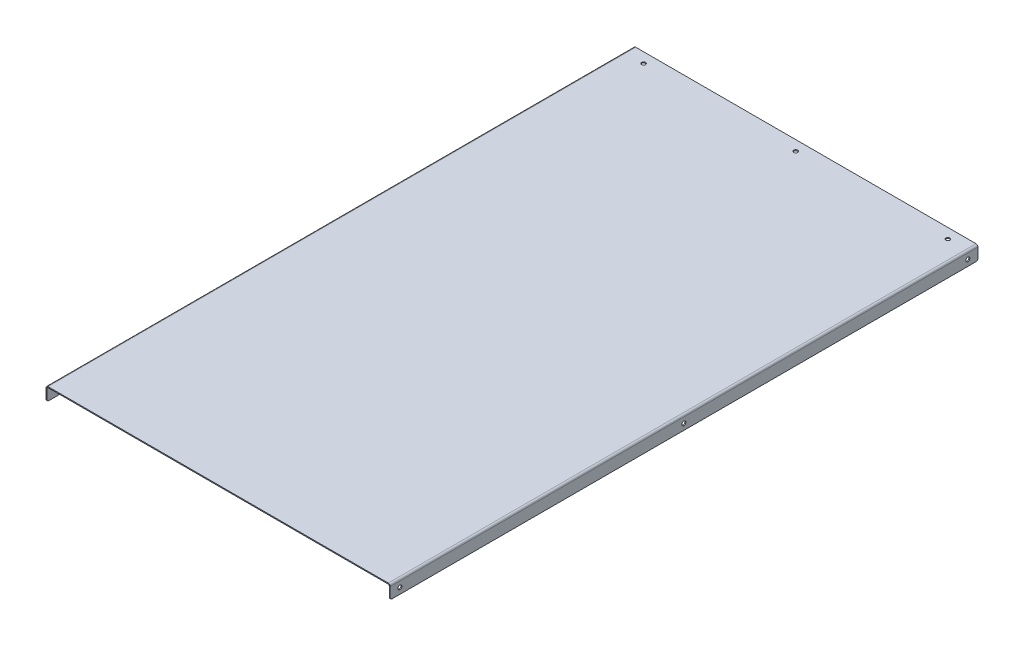
ISO-10303-21;
HEADER;
FILE_DESCRIPTION(('STEP AP214'),'2;1');
FILE_NAME('part.step','',(''),(''),'','','');
FILE_SCHEMA(('AUTOMOTIVE_DESIGN { 1 0 10303 214 1 1 1 1 }'));
ENDSEC;
DATA;
#1=APPLICATION_CONTEXT('core data for automotive mechanical design processes');
#2=APPLICATION_PROTOCOL_DEFINITION('international standard','automotive_design',2000,#1);
#3=PRODUCT_CONTEXT('',#1,'mechanical');
#4=PRODUCT('Part','Part','',(#3));
#5=PRODUCT_RELATED_PRODUCT_CATEGORY('part','',(#4));
#6=PRODUCT_DEFINITION_FORMATION('','',#4);
#7=PRODUCT_DEFINITION_CONTEXT('part definition',#1,'design');
#8=PRODUCT_DEFINITION('design','',#6,#7);
#9=PRODUCT_DEFINITION_SHAPE('','',#8);
#10=(LENGTH_UNIT() NAMED_UNIT(*) SI_UNIT(.MILLI.,.METRE.));
#11=(NAMED_UNIT(*) PLANE_ANGLE_UNIT() SI_UNIT($,.RADIAN.));
#12=(NAMED_UNIT(*) SI_UNIT($,.STERADIAN.) SOLID_ANGLE_UNIT());
#13=UNCERTAINTY_MEASURE_WITH_UNIT(LENGTH_MEASURE(1.E-05),#10,'distance_accuracy_value','');
#14=(GEOMETRIC_REPRESENTATION_CONTEXT(3) GLOBAL_UNCERTAINTY_ASSIGNED_CONTEXT((#13)) GLOBAL_UNIT_ASSIGNED_CONTEXT((#10,
#11,#12)) REPRESENTATION_CONTEXT('',''));
#15=CARTESIAN_POINT('',(0.,0.,0.));
#16=DIRECTION('',(0.,0.,1.));
#17=DIRECTION('',(1.,0.,0.));
#18=AXIS2_PLACEMENT_3D('',#15,#16,#17);
#19=CARTESIAN_POINT('',(-213.0552,0.,0.));
#20=DIRECTION('',(0.,0.,-1.));
#21=DIRECTION('',(-1.,0.,0.));
#22=AXIS2_PLACEMENT_3D('',#19,#20,#21);
#23=PLANE('',#22);
#24=DIRECTION('',(0.,1.,0.));
#25=VECTOR('',#24,1.);
#26=CARTESIAN_POINT('',(-213.0552,0.,0.));
#27=LINE('',#26,#25);
#28=CARTESIAN_POINT('',(-213.0552,0.,0.));
#29=VERTEX_POINT('',#28);
#30=CARTESIAN_POINT('',(-213.0552,1.2192,0.));
#31=VERTEX_POINT('',#30);
#32=EDGE_CURVE('E206',#29,#31,#27,.T.);
#33=ORIENTED_EDGE('',*,*,#32,.F.);
#34=CARTESIAN_POINT('',(-213.0552,-1.27,0.));
#35=DIRECTION('',(0.,0.,1.));
#36=DIRECTION('',(1.,0.,0.));
#37=AXIS2_PLACEMENT_3D('',#34,#35,#36);
#38=CIRCLE('',#37,1.27);
#39=CARTESIAN_POINT('',(-214.3252,-1.27,0.));
#40=VERTEX_POINT('',#39);
#41=EDGE_CURVE('E308',#40,#29,#38,.F.);
#42=ORIENTED_EDGE('',*,*,#41,.F.);
#43=DIRECTION('',(1.,0.,0.));
#44=VECTOR('',#43,1.);
#45=CARTESIAN_POINT('',(-215.5444,-1.27,0.));
#46=LINE('',#45,#44);
#47=CARTESIAN_POINT('',(-215.5444,-1.27,0.));
#48=VERTEX_POINT('',#47);
#49=EDGE_CURVE('E203',#48,#40,#46,.T.);
#50=ORIENTED_EDGE('',*,*,#49,.F.);
#51=CARTESIAN_POINT('',(-213.0552,-1.27,0.));
#52=DIRECTION('',(0.,0.,1.));
#53=DIRECTION('',(1.,0.,0.));
#54=AXIS2_PLACEMENT_3D('',#51,#52,#53);
#55=CIRCLE('',#54,2.4892);
#56=EDGE_CURVE('E301',#48,#31,#55,.F.);
#57=ORIENTED_EDGE('',*,*,#56,.T.);
#58=EDGE_LOOP('',(#33,#42,#50,#57));
#59=FACE_BOUND('',#58,.T.);
#60=ADVANCED_FACE('F37',(#59),#23,.T.);
#61=CARTESIAN_POINT('',(-215.5444,-1.27,0.));
#62=DIRECTION('',(0.,0.,-1.));
#63=DIRECTION('',(-1.,0.,0.));
#64=AXIS2_PLACEMENT_3D('',#61,#62,#63);
#65=PLANE('',#64);
#66=DIRECTION('',(1.,0.,0.));
#67=VECTOR('',#66,1.);
#68=CARTESIAN_POINT('',(-214.3252,0.,0.));
#69=LINE('',#68,#67);
#70=CARTESIAN_POINT('',(213.0552,0.,0.));
#71=VERTEX_POINT('',#70);
#72=EDGE_CURVE('E311',#29,#71,#69,.T.);
#73=ORIENTED_EDGE('',*,*,#72,.F.);
#74=ORIENTED_EDGE('',*,*,#32,.T.);
#75=DIRECTION('',(1.,0.,0.));
#76=VECTOR('',#75,1.);
#77=CARTESIAN_POINT('',(-214.3252,1.2192,0.));
#78=LINE('',#77,#76);
#79=CARTESIAN_POINT('',(213.0552,1.21920000000008,0.));
#80=VERTEX_POINT('',#79);
#81=EDGE_CURVE('E298',#31,#80,#78,.T.);
#82=ORIENTED_EDGE('',*,*,#81,.T.);
#83=DIRECTION('',(0.,-1.,0.));
#84=VECTOR('',#83,1.);
#85=CARTESIAN_POINT('',(213.0552,1.21920000000008,0.));
#86=LINE('',#85,#84);
#87=EDGE_CURVE('E199',#80,#71,#86,.T.);
#88=ORIENTED_EDGE('',*,*,#87,.T.);
#89=EDGE_LOOP('',(#73,#74,#82,#88));
#90=FACE_BOUND('',#89,.T.);
#91=ADVANCED_FACE('F391',(#90),#65,.T.);
#92=CARTESIAN_POINT('',(214.3252,-1.26999999999992,0.));
#93=DIRECTION('',(0.,0.,-1.));
#94=DIRECTION('',(-1.,0.,0.));
#95=AXIS2_PLACEMENT_3D('',#92,#93,#94);
#96=PLANE('',#95);
#97=DIRECTION('',(1.,0.,0.));
#98=VECTOR('',#97,1.);
#99=CARTESIAN_POINT('',(214.3252,-1.26999999999992,0.));
#100=LINE('',#99,#98);
#101=CARTESIAN_POINT('',(214.3252,-1.26999999999992,0.));
#102=VERTEX_POINT('',#101);
#103=CARTESIAN_POINT('',(215.5444,-1.26999999999992,0.));
#104=VERTEX_POINT('',#103);
#105=EDGE_CURVE('E201',#102,#104,#100,.T.);
#106=ORIENTED_EDGE('',*,*,#105,.F.);
#107=CARTESIAN_POINT('',(213.0552,-1.26999999999992,0.));
#108=DIRECTION('',(0.,0.,1.));
#109=DIRECTION('',(1.,0.,0.));
#110=AXIS2_PLACEMENT_3D('',#107,#108,#109);
#111=CIRCLE('',#110,1.27);
#112=EDGE_CURVE('E314',#71,#102,#111,.F.);
#113=ORIENTED_EDGE('',*,*,#112,.F.);
#114=ORIENTED_EDGE('',*,*,#87,.F.);
#115=CARTESIAN_POINT('',(213.0552,-1.26999999999992,0.));
#116=DIRECTION('',(0.,0.,1.));
#117=DIRECTION('',(1.,0.,0.));
#118=AXIS2_PLACEMENT_3D('',#115,#116,#117);
#119=CIRCLE('',#118,2.4892);
#120=EDGE_CURVE('E296',#80,#104,#119,.F.);
#121=ORIENTED_EDGE('',*,*,#120,.T.);
#122=EDGE_LOOP('',(#106,#113,#114,#121));
#123=FACE_BOUND('',#122,.T.);
#124=ADVANCED_FACE('F396',(#123),#96,.T.);
#125=CARTESIAN_POINT('',(213.0552,1.21920000000008,0.));
#126=DIRECTION('',(0.,0.,-1.));
#127=DIRECTION('',(-1.,0.,0.));
#128=AXIS2_PLACEMENT_3D('',#125,#126,#127);
#129=PLANE('',#128);
#130=DIRECTION('',(0.,1.,0.));
#131=VECTOR('',#130,1.);
#132=CARTESIAN_POINT('',(215.5444,0.,0.));
#133=LINE('',#132,#131);
#134=CARTESIAN_POINT('',(215.5444,-13.3349999999999,0.));
#135=VERTEX_POINT('',#134);
#136=EDGE_CURVE('E188',#104,#135,#133,.F.);
#137=ORIENTED_EDGE('',*,*,#136,.T.);
#138=DIRECTION('',(-1.,0.,0.));
#139=VECTOR('',#138,1.);
#140=CARTESIAN_POINT('',(213.0552,-13.3349999999999,0.));
#141=LINE('',#140,#139);
#142=CARTESIAN_POINT('',(214.3252,-13.3349999999999,0.));
#143=VERTEX_POINT('',#142);
#144=EDGE_CURVE('E224',#135,#143,#141,.T.);
#145=ORIENTED_EDGE('',*,*,#144,.T.);
#146=DIRECTION('',(0.,-1.,0.));
#147=VECTOR('',#146,1.);
#148=CARTESIAN_POINT('',(214.3252,0.,0.));
#149=LINE('',#148,#147);
#150=EDGE_CURVE('E173',#102,#143,#149,.T.);
#151=ORIENTED_EDGE('',*,*,#150,.F.);
#152=ORIENTED_EDGE('',*,*,#105,.T.);
#153=EDGE_LOOP('',(#137,#145,#151,#152));
#154=FACE_BOUND('',#153,.T.);
#155=ADVANCED_FACE('F419',(#154),#129,.T.);
#156=CARTESIAN_POINT('',(214.3252,0.,1168.02758970549));
#157=DIRECTION('',(1.,0.,0.));
#158=DIRECTION('',(0.,0.,-1.));
#159=AXIS2_PLACEMENT_3D('',#156,#157,#158);
#160=PLANE('',#159);
#161=CARTESIAN_POINT('',(214.3252,-8.3058,12.6999999999978));
#162=DIRECTION('',(1.,0.,0.));
#163=DIRECTION('',(0.,0.,-1.));
#164=AXIS2_PLACEMENT_3D('',#161,#162,#163);
#165=CIRCLE('',#164,2.47650000000304);
#166=CARTESIAN_POINT('',(214.3252,-8.3058,10.2234999999948));
#167=VERTEX_POINT('',#166);
#168=EDGE_CURVE('E257',#167,#167,#165,.T.);
#169=ORIENTED_EDGE('',*,*,#168,.T.);
#170=EDGE_LOOP('',(#169));
#171=FACE_BOUND('',#170,.T.);
#172=CARTESIAN_POINT('',(214.3252,-8.3058,723.899999999998));
#173=DIRECTION('',(1.,0.,0.));
#174=DIRECTION('',(0.,0.,-1.));
#175=AXIS2_PLACEMENT_3D('',#172,#173,#174);
#176=CIRCLE('',#175,2.47650000000299);
#177=CARTESIAN_POINT('',(214.3252,-8.3058,721.423499999995));
#178=VERTEX_POINT('',#177);
#179=EDGE_CURVE('E244',#178,#178,#176,.T.);
#180=ORIENTED_EDGE('',*,*,#179,.T.);
#181=EDGE_LOOP('',(#180));
#182=FACE_BOUND('',#181,.T.);
#183=CARTESIAN_POINT('',(214.3252,-8.3058,368.299999999998));
#184=DIRECTION('',(1.,0.,0.));
#185=DIRECTION('',(0.,0.,-1.));
#186=AXIS2_PLACEMENT_3D('',#183,#184,#185);
#187=CIRCLE('',#186,2.47650000000301);
#188=CARTESIAN_POINT('',(214.3252,-8.3058,365.823499999995));
#189=VERTEX_POINT('',#188);
#190=EDGE_CURVE('E240',#189,#189,#187,.T.);
#191=ORIENTED_EDGE('',*,*,#190,.T.);
#192=EDGE_LOOP('',(#191));
#193=FACE_BOUND('',#192,.T.);
#194=ORIENTED_EDGE('',*,*,#150,.T.);
#195=CARTESIAN_POINT('',(214.3252,-13.3349999999999,2.54));
#196=DIRECTION('',(1.,0.,0.));
#197=DIRECTION('',(0.,0.,-1.));
#198=AXIS2_PLACEMENT_3D('',#195,#196,#197);
#199=CIRCLE('',#198,2.54);
#200=CARTESIAN_POINT('',(214.3252,-15.8749999999999,2.53999999999999));
#201=VERTEX_POINT('',#200);
#202=EDGE_CURVE('E229',#143,#201,#199,.F.);
#203=ORIENTED_EDGE('',*,*,#202,.T.);
#204=DIRECTION('',(0.,0.,-1.));
#205=VECTOR('',#204,1.);
#206=CARTESIAN_POINT('',(214.3252,-15.8749999999999,1168.02758970549));
#207=LINE('',#206,#205);
#208=CARTESIAN_POINT('',(214.3252,-15.8749999999999,733.552000000013));
#209=VERTEX_POINT('',#208);
#210=EDGE_CURVE('E192',#209,#201,#207,.T.);
#211=ORIENTED_EDGE('',*,*,#210,.F.);
#212=CARTESIAN_POINT('',(214.3252,-13.3349999999999,733.552000000013));
#213=DIRECTION('',(1.,0.,0.));
#214=DIRECTION('',(0.,0.,-1.));
#215=AXIS2_PLACEMENT_3D('',#212,#213,#214);
#216=CIRCLE('',#215,2.54);
#217=CARTESIAN_POINT('',(214.3252,-13.3349999999999,736.092000000013));
#218=VERTEX_POINT('',#217);
#219=EDGE_CURVE('E227',#209,#218,#216,.F.);
#220=ORIENTED_EDGE('',*,*,#219,.T.);
#221=DIRECTION('',(0.,1.,0.));
#222=VECTOR('',#221,1.);
#223=CARTESIAN_POINT('',(214.3252,0.,736.092000000013));
#224=LINE('',#223,#222);
#225=CARTESIAN_POINT('',(214.3252,-1.26999999999992,736.092000000013));
#226=VERTEX_POINT('',#225);
#227=EDGE_CURVE('E162',#218,#226,#224,.T.);
#228=ORIENTED_EDGE('',*,*,#227,.T.);
#229=DIRECTION('',(0.,0.,-1.));
#230=VECTOR('',#229,1.);
#231=CARTESIAN_POINT('',(214.3252,-1.26999999999992,1168.02758970549));
#232=LINE('',#231,#230);
#233=EDGE_CURVE('E317',#226,#102,#232,.T.);
#234=ORIENTED_EDGE('',*,*,#233,.T.);
#235=EDGE_LOOP('',(#194,#203,#211,#220,#228,#234));
#236=FACE_BOUND('',#235,.T.);
#237=ADVANCED_FACE('F414',(#171,#182,#193,#236),#160,.F.);
#238=CARTESIAN_POINT('',(215.5444,-15.8749999999999,1168.02758970549));
#239=DIRECTION('',(0.,-1.,0.));
#240=DIRECTION('',(0.,0.,-1.));
#241=AXIS2_PLACEMENT_3D('',#238,#239,#240);
#242=PLANE('',#241);
#243=ORIENTED_EDGE('',*,*,#210,.T.);
#244=DIRECTION('',(-1.,0.,0.));
#245=VECTOR('',#244,1.);
#246=CARTESIAN_POINT('',(215.5444,-15.8749999999999,2.53999999999999));
#247=LINE('',#246,#245);
#248=CARTESIAN_POINT('',(215.5444,-15.8749999999999,2.53999999999999));
#249=VERTEX_POINT('',#248);
#250=EDGE_CURVE('E62',#201,#249,#247,.F.);
#251=ORIENTED_EDGE('',*,*,#250,.T.);
#252=DIRECTION('',(0.,0.,-1.));
#253=VECTOR('',#252,1.);
#254=CARTESIAN_POINT('',(215.5444,-15.8749999999999,1168.02758970549));
#255=LINE('',#254,#253);
#256=CARTESIAN_POINT('',(215.5444,-15.8749999999999,733.552000000013));
#257=VERTEX_POINT('',#256);
#258=EDGE_CURVE('E190',#257,#249,#255,.T.);
#259=ORIENTED_EDGE('',*,*,#258,.F.);
#260=DIRECTION('',(-1.,0.,0.));
#261=VECTOR('',#260,1.);
#262=CARTESIAN_POINT('',(215.5444,-15.8749999999999,733.552000000013));
#263=LINE('',#262,#261);
#264=EDGE_CURVE('E231',#257,#209,#263,.T.);
#265=ORIENTED_EDGE('',*,*,#264,.T.);
#266=EDGE_LOOP('',(#243,#251,#259,#265));
#267=FACE_BOUND('',#266,.T.);
#268=ADVANCED_FACE('F415',(#267),#242,.T.);
#269=CARTESIAN_POINT('',(215.5444,0.,1168.02758970549));
#270=DIRECTION('',(1.,0.,0.));
#271=DIRECTION('',(0.,0.,-1.));
#272=AXIS2_PLACEMENT_3D('',#269,#270,#271);
#273=PLANE('',#272);
#274=CARTESIAN_POINT('',(215.5444,-8.3058,12.6999999999978));
#275=DIRECTION('',(1.,0.,0.));
#276=DIRECTION('',(0.,0.,-1.));
#277=AXIS2_PLACEMENT_3D('',#274,#275,#276);
#278=CIRCLE('',#277,2.47650000000304);
#279=CARTESIAN_POINT('',(215.5444,-8.3058,10.2234999999948));
#280=VERTEX_POINT('',#279);
#281=EDGE_CURVE('E492',#280,#280,#278,.T.);
#282=ORIENTED_EDGE('',*,*,#281,.F.);
#283=EDGE_LOOP('',(#282));
#284=FACE_BOUND('',#283,.T.);
#285=CARTESIAN_POINT('',(215.5444,-8.3058,723.899999999998));
#286=DIRECTION('',(1.,0.,0.));
#287=DIRECTION('',(0.,0.,-1.));
#288=AXIS2_PLACEMENT_3D('',#285,#286,#287);
#289=CIRCLE('',#288,2.47650000000299);
#290=CARTESIAN_POINT('',(215.5444,-8.3058,721.423499999995));
#291=VERTEX_POINT('',#290);
#292=EDGE_CURVE('E252',#291,#291,#289,.T.);
#293=ORIENTED_EDGE('',*,*,#292,.F.);
#294=EDGE_LOOP('',(#293));
#295=FACE_BOUND('',#294,.T.);
#296=CARTESIAN_POINT('',(215.5444,-8.3058,368.299999999998));
#297=DIRECTION('',(1.,0.,0.));
#298=DIRECTION('',(0.,0.,-1.));
#299=AXIS2_PLACEMENT_3D('',#296,#297,#298);
#300=CIRCLE('',#299,2.47650000000301);
#301=CARTESIAN_POINT('',(215.5444,-8.3058,365.823499999995));
#302=VERTEX_POINT('',#301);
#303=EDGE_CURVE('E249',#302,#302,#300,.T.);
#304=ORIENTED_EDGE('',*,*,#303,.F.);
#305=EDGE_LOOP('',(#304));
#306=FACE_BOUND('',#305,.T.);
#307=ORIENTED_EDGE('',*,*,#258,.T.);
#308=CARTESIAN_POINT('',(215.5444,-13.3349999999999,2.54));
#309=DIRECTION('',(1.,0.,0.));
#310=DIRECTION('',(0.,0.,-1.));
#311=AXIS2_PLACEMENT_3D('',#308,#309,#310);
#312=CIRCLE('',#311,2.54);
#313=EDGE_CURVE('E235',#249,#135,#312,.T.);
#314=ORIENTED_EDGE('',*,*,#313,.T.);
#315=ORIENTED_EDGE('',*,*,#136,.F.);
#316=DIRECTION('',(0.,0.,-1.));
#317=VECTOR('',#316,1.);
#318=CARTESIAN_POINT('',(215.5444,-1.26999999999992,1168.02758970549));
#319=LINE('',#318,#317);
#320=CARTESIAN_POINT('',(215.5444,-1.26999999999992,736.092000000013));
#321=VERTEX_POINT('',#320);
#322=EDGE_CURVE('E180',#321,#104,#319,.T.);
#323=ORIENTED_EDGE('',*,*,#322,.F.);
#324=DIRECTION('',(0.,1.,0.));
#325=VECTOR('',#324,1.);
#326=CARTESIAN_POINT('',(215.5444,0.,736.092000000013));
#327=LINE('',#326,#325);
#328=CARTESIAN_POINT('',(215.5444,-13.3349999999999,736.092000000013));
#329=VERTEX_POINT('',#328);
#330=EDGE_CURVE('E154',#329,#321,#327,.T.);
#331=ORIENTED_EDGE('',*,*,#330,.F.);
#332=CARTESIAN_POINT('',(215.5444,-13.3349999999999,733.552000000013));
#333=DIRECTION('',(1.,0.,0.));
#334=DIRECTION('',(0.,0.,-1.));
#335=AXIS2_PLACEMENT_3D('',#332,#333,#334);
#336=CIRCLE('',#335,2.54);
#337=EDGE_CURVE('E54',#329,#257,#336,.T.);
#338=ORIENTED_EDGE('',*,*,#337,.T.);
#339=EDGE_LOOP('',(#307,#314,#315,#323,#331,#338));
#340=FACE_BOUND('',#339,.T.);
#341=ADVANCED_FACE('F186',(#284,#295,#306,#340),#273,.T.);
#342=CARTESIAN_POINT('',(213.0552,-1.26999999999992,1168.02758970549));
#343=DIRECTION('',(0.,0.,-1.));
#344=DIRECTION('',(-1.,0.,0.));
#345=AXIS2_PLACEMENT_3D('',#342,#343,#344);
#346=CYLINDRICAL_SURFACE('',#345,2.4892);
#347=DIRECTION('',(0.,0.,-1.));
#348=VECTOR('',#347,1.);
#349=CARTESIAN_POINT('',(213.0552,1.21920000000008,1168.02758970549));
#350=LINE('',#349,#348);
#351=CARTESIAN_POINT('',(213.0552,1.21920000000008,736.092000000013));
#352=VERTEX_POINT('',#351);
#353=EDGE_CURVE('E183',#352,#80,#350,.T.);
#354=ORIENTED_EDGE('',*,*,#353,.F.);
#355=CARTESIAN_POINT('',(213.0552,-1.26999999999992,736.092000000013));
#356=DIRECTION('',(0.,0.,1.));
#357=DIRECTION('',(1.,0.,0.));
#358=AXIS2_PLACEMENT_3D('',#355,#356,#357);
#359=CIRCLE('',#358,2.4892);
#360=EDGE_CURVE('E168',#321,#352,#359,.T.);
#361=ORIENTED_EDGE('',*,*,#360,.F.);
#362=ORIENTED_EDGE('',*,*,#322,.T.);
#363=ORIENTED_EDGE('',*,*,#120,.F.);
#364=EDGE_LOOP('',(#354,#361,#362,#363));
#365=FACE_BOUND('',#364,.T.);
#366=ADVANCED_FACE('F178',(#365),#346,.T.);
#367=CARTESIAN_POINT('',(-214.3252,1.2192,1168.02758970549));
#368=DIRECTION('',(0.,1.,0.));
#369=DIRECTION('',(-1.,0.,0.));
#370=AXIS2_PLACEMENT_3D('',#367,#368,#369);
#371=PLANE('',#370);
#372=CARTESIAN_POINT('',(190.500000000005,1.21920000000007,12.6999999999947));
#373=DIRECTION('',(0.,1.,0.));
#374=DIRECTION('',(-1.,0.,0.));
#375=AXIS2_PLACEMENT_3D('',#372,#373,#374);
#376=CIRCLE('',#375,2.47649999999429);
#377=CARTESIAN_POINT('',(188.02350000001,1.21920000000007,12.6999999999947));
#378=VERTEX_POINT('',#377);
#379=EDGE_CURVE('E477',#378,#378,#376,.T.);
#380=ORIENTED_EDGE('',*,*,#379,.F.);
#381=EDGE_LOOP('',(#380));
#382=FACE_BOUND('',#381,.T.);
#383=CARTESIAN_POINT('',(4.72347256060702E-12,1.21920000000004,12.6999999999947));
#384=DIRECTION('',(0.,1.,0.));
#385=DIRECTION('',(-1.,0.,0.));
#386=AXIS2_PLACEMENT_3D('',#383,#384,#385);
#387=CIRCLE('',#386,2.47649999999378);
#388=CARTESIAN_POINT('',(-2.47649999998906,1.21920000000004,12.6999999999947));
#389=VERTEX_POINT('',#388);
#390=EDGE_CURVE('E480',#389,#389,#387,.T.);
#391=ORIENTED_EDGE('',*,*,#390,.F.);
#392=EDGE_LOOP('',(#391));
#393=FACE_BOUND('',#392,.T.);
#394=CARTESIAN_POINT('',(-190.499999999995,1.2192,12.6999999999948));
#395=DIRECTION('',(0.,1.,0.));
#396=DIRECTION('',(-1.,0.,0.));
#397=AXIS2_PLACEMENT_3D('',#394,#395,#396);
#398=CIRCLE('',#397,2.47649999999395);
#399=CARTESIAN_POINT('',(-192.976499999989,1.2192,12.6999999999948));
#400=VERTEX_POINT('',#399);
#401=EDGE_CURVE('E486',#400,#400,#398,.T.);
#402=ORIENTED_EDGE('',*,*,#401,.F.);
#403=EDGE_LOOP('',(#402));
#404=FACE_BOUND('',#403,.T.);
#405=DIRECTION('',(0.,0.,-1.));
#406=VECTOR('',#405,1.);
#407=CARTESIAN_POINT('',(-213.0552,1.2192,1168.02758970549));
#408=LINE('',#407,#406);
#409=CARTESIAN_POINT('',(-213.0552,1.2192,736.092000000013));
#410=VERTEX_POINT('',#409);
#411=EDGE_CURVE('E194',#410,#31,#408,.T.);
#412=ORIENTED_EDGE('',*,*,#411,.F.);
#413=DIRECTION('',(-1.,0.,0.));
#414=VECTOR('',#413,1.);
#415=CARTESIAN_POINT('',(-214.3252,1.2192,736.092000000013));
#416=LINE('',#415,#414);
#417=EDGE_CURVE('E283',#352,#410,#416,.T.);
#418=ORIENTED_EDGE('',*,*,#417,.F.);
#419=ORIENTED_EDGE('',*,*,#353,.T.);
#420=ORIENTED_EDGE('',*,*,#81,.F.);
#421=EDGE_LOOP('',(#412,#418,#419,#420));
#422=FACE_BOUND('',#421,.T.);
#423=ADVANCED_FACE('F347',(#382,#393,#404,#422),#371,.T.);
#424=CARTESIAN_POINT('',(-213.0552,-1.27,1168.02758970549));
#425=DIRECTION('',(0.,0.,-1.));
#426=DIRECTION('',(-1.,0.,0.));
#427=AXIS2_PLACEMENT_3D('',#424,#425,#426);
#428=CYLINDRICAL_SURFACE('',#427,2.4892);
#429=DIRECTION('',(0.,0.,-1.));
#430=VECTOR('',#429,1.);
#431=CARTESIAN_POINT('',(-215.5444,-1.27,1168.02758970549));
#432=LINE('',#431,#430);
#433=CARTESIAN_POINT('',(-215.5444,-1.27,736.092000000013));
#434=VERTEX_POINT('',#433);
#435=EDGE_CURVE('E335',#434,#48,#432,.T.);
#436=ORIENTED_EDGE('',*,*,#435,.F.);
#437=CARTESIAN_POINT('',(-213.0552,-1.27,736.092000000013));
#438=DIRECTION('',(0.,0.,1.));
#439=DIRECTION('',(1.,0.,0.));
#440=AXIS2_PLACEMENT_3D('',#437,#438,#439);
#441=CIRCLE('',#440,2.4892);
#442=EDGE_CURVE('E271',#410,#434,#441,.T.);
#443=ORIENTED_EDGE('',*,*,#442,.F.);
#444=ORIENTED_EDGE('',*,*,#411,.T.);
#445=ORIENTED_EDGE('',*,*,#56,.F.);
#446=EDGE_LOOP('',(#436,#443,#444,#445));
#447=FACE_BOUND('',#446,.T.);
#448=ADVANCED_FACE('F344',(#447),#428,.T.);
#449=CARTESIAN_POINT('',(-215.5444,-15.875,1168.02758970549));
#450=DIRECTION('',(-1.,0.,0.));
#451=DIRECTION('',(0.,0.,1.));
#452=AXIS2_PLACEMENT_3D('',#449,#450,#451);
#453=PLANE('',#452);
#454=CARTESIAN_POINT('',(-215.5444,-8.3058,12.6999999999978));
#455=DIRECTION('',(1.,0.,0.));
#456=DIRECTION('',(0.,0.,-1.));
#457=AXIS2_PLACEMENT_3D('',#454,#455,#456);
#458=CIRCLE('',#457,2.47650000000304);
#459=CARTESIAN_POINT('',(-215.5444,-8.3058,10.2234999999948));
#460=VERTEX_POINT('',#459);
#461=EDGE_CURVE('E495',#460,#460,#458,.T.);
#462=ORIENTED_EDGE('',*,*,#461,.T.);
#463=EDGE_LOOP('',(#462));
#464=FACE_BOUND('',#463,.T.);
#465=CARTESIAN_POINT('',(-215.5444,-8.3058,723.899999999998));
#466=DIRECTION('',(1.,0.,0.));
#467=DIRECTION('',(0.,0.,-1.));
#468=AXIS2_PLACEMENT_3D('',#465,#466,#467);
#469=CIRCLE('',#468,2.47650000000299);
#470=CARTESIAN_POINT('',(-215.5444,-8.3058,721.423499999995));
#471=VERTEX_POINT('',#470);
#472=EDGE_CURVE('E245',#471,#471,#469,.T.);
#473=ORIENTED_EDGE('',*,*,#472,.T.);
#474=EDGE_LOOP('',(#473));
#475=FACE_BOUND('',#474,.T.);
#476=CARTESIAN_POINT('',(-215.5444,-8.3058,368.299999999998));
#477=DIRECTION('',(1.,0.,0.));
#478=DIRECTION('',(0.,0.,-1.));
#479=AXIS2_PLACEMENT_3D('',#476,#477,#478);
#480=CIRCLE('',#479,2.47650000000301);
#481=CARTESIAN_POINT('',(-215.5444,-8.3058,365.823499999995));
#482=VERTEX_POINT('',#481);
#483=EDGE_CURVE('E241',#482,#482,#480,.T.);
#484=ORIENTED_EDGE('',*,*,#483,.T.);
#485=EDGE_LOOP('',(#484));
#486=FACE_BOUND('',#485,.T.);
#487=DIRECTION('',(0.,1.,0.));
#488=VECTOR('',#487,1.);
#489=CARTESIAN_POINT('',(-215.5444,-15.875,0.));
#490=LINE('',#489,#488);
#491=CARTESIAN_POINT('',(-215.5444,-13.335,0.));
#492=VERTEX_POINT('',#491);
#493=EDGE_CURVE('E304',#492,#48,#490,.T.);
#494=ORIENTED_EDGE('',*,*,#493,.F.);
#495=CARTESIAN_POINT('',(-215.5444,-13.335,2.54));
#496=DIRECTION('',(-1.,0.,0.));
#497=DIRECTION('',(0.,0.,1.));
#498=AXIS2_PLACEMENT_3D('',#495,#496,#497);
#499=CIRCLE('',#498,2.54);
#500=CARTESIAN_POINT('',(-215.5444,-15.875,2.53999999999999));
#501=VERTEX_POINT('',#500);
#502=EDGE_CURVE('E213',#492,#501,#499,.T.);
#503=ORIENTED_EDGE('',*,*,#502,.T.);
#504=DIRECTION('',(0.,0.,-1.));
#505=VECTOR('',#504,1.);
#506=CARTESIAN_POINT('',(-215.5444,-15.875,1168.02758970549));
#507=LINE('',#506,#505);
#508=CARTESIAN_POINT('',(-215.5444,-15.875,733.552000000013));
#509=VERTEX_POINT('',#508);
#510=EDGE_CURVE('E332',#509,#501,#507,.T.);
#511=ORIENTED_EDGE('',*,*,#510,.F.);
#512=CARTESIAN_POINT('',(-215.5444,-13.335,733.552000000013));
#513=DIRECTION('',(-1.,0.,0.));
#514=DIRECTION('',(0.,0.,1.));
#515=AXIS2_PLACEMENT_3D('',#512,#513,#514);
#516=CIRCLE('',#515,2.54);
#517=CARTESIAN_POINT('',(-215.5444,-13.335,736.092000000013));
#518=VERTEX_POINT('',#517);
#519=EDGE_CURVE('E211',#509,#518,#516,.T.);
#520=ORIENTED_EDGE('',*,*,#519,.T.);
#521=DIRECTION('',(0.,1.,0.));
#522=VECTOR('',#521,1.);
#523=CARTESIAN_POINT('',(-215.5444,-15.875,736.092000000013));
#524=LINE('',#523,#522);
#525=EDGE_CURVE('E274',#434,#518,#524,.F.);
#526=ORIENTED_EDGE('',*,*,#525,.F.);
#527=ORIENTED_EDGE('',*,*,#435,.T.);
#528=EDGE_LOOP('',(#494,#503,#511,#520,#526,#527));
#529=FACE_BOUND('',#528,.T.);
#530=ADVANCED_FACE('F357',(#464,#475,#486,#529),#453,.T.);
#531=CARTESIAN_POINT('',(-214.3252,-15.875,1168.02758970549));
#532=DIRECTION('',(0.,-1.,0.));
#533=DIRECTION('',(0.,0.,-1.));
#534=AXIS2_PLACEMENT_3D('',#531,#532,#533);
#535=PLANE('',#534);
#536=ORIENTED_EDGE('',*,*,#510,.T.);
#537=DIRECTION('',(-1.,0.,0.));
#538=VECTOR('',#537,1.);
#539=CARTESIAN_POINT('',(-214.3252,-15.875,2.54));
#540=LINE('',#539,#538);
#541=CARTESIAN_POINT('',(-214.3252,-15.875,2.53999999999999));
#542=VERTEX_POINT('',#541);
#543=EDGE_CURVE('E218',#501,#542,#540,.F.);
#544=ORIENTED_EDGE('',*,*,#543,.T.);
#545=DIRECTION('',(0.,0.,-1.));
#546=VECTOR('',#545,1.);
#547=CARTESIAN_POINT('',(-214.3252,-15.875,1168.02758970549));
#548=LINE('',#547,#546);
#549=CARTESIAN_POINT('',(-214.3252,-15.875,733.552000000013));
#550=VERTEX_POINT('',#549);
#551=EDGE_CURVE('E329',#550,#542,#548,.T.);
#552=ORIENTED_EDGE('',*,*,#551,.F.);
#553=DIRECTION('',(1.,0.,0.));
#554=VECTOR('',#553,1.);
#555=CARTESIAN_POINT('',(-214.3252,-15.875,733.552000000013));
#556=LINE('',#555,#554);
#557=EDGE_CURVE('E215',#550,#509,#556,.F.);
#558=ORIENTED_EDGE('',*,*,#557,.T.);
#559=EDGE_LOOP('',(#536,#544,#552,#558));
#560=FACE_BOUND('',#559,.T.);
#561=ADVANCED_FACE('F372',(#560),#535,.T.);
#562=CARTESIAN_POINT('',(-214.3252,-15.875,1168.02758970549));
#563=DIRECTION('',(-1.,0.,0.));
#564=DIRECTION('',(0.,0.,1.));
#565=AXIS2_PLACEMENT_3D('',#562,#563,#564);
#566=PLANE('',#565);
#567=CARTESIAN_POINT('',(-214.3252,-8.3058,12.6999999999978));
#568=DIRECTION('',(-1.,0.,0.));
#569=DIRECTION('',(0.,0.,1.));
#570=AXIS2_PLACEMENT_3D('',#567,#568,#569);
#571=CIRCLE('',#570,2.47650000000304);
#572=CARTESIAN_POINT('',(-214.3252,-8.3058,15.1765000000009));
#573=VERTEX_POINT('',#572);
#574=EDGE_CURVE('E41',#573,#573,#571,.T.);
#575=ORIENTED_EDGE('',*,*,#574,.T.);
#576=EDGE_LOOP('',(#575));
#577=FACE_BOUND('',#576,.T.);
#578=CARTESIAN_POINT('',(-214.3252,-8.3058,723.899999999998));
#579=DIRECTION('',(-1.,0.,0.));
#580=DIRECTION('',(0.,0.,1.));
#581=AXIS2_PLACEMENT_3D('',#578,#579,#580);
#582=CIRCLE('',#581,2.47650000000299);
#583=CARTESIAN_POINT('',(-214.3252,-8.3058,726.376500000001));
#584=VERTEX_POINT('',#583);
#585=EDGE_CURVE('E242',#584,#584,#582,.T.);
#586=ORIENTED_EDGE('',*,*,#585,.T.);
#587=EDGE_LOOP('',(#586));
#588=FACE_BOUND('',#587,.T.);
#589=CARTESIAN_POINT('',(-214.3252,-8.3058,368.299999999998));
#590=DIRECTION('',(-1.,0.,0.));
#591=DIRECTION('',(0.,0.,1.));
#592=AXIS2_PLACEMENT_3D('',#589,#590,#591);
#593=CIRCLE('',#592,2.47650000000301);
#594=CARTESIAN_POINT('',(-214.3252,-8.3058,370.776500000001));
#595=VERTEX_POINT('',#594);
#596=EDGE_CURVE('E238',#595,#595,#593,.T.);
#597=ORIENTED_EDGE('',*,*,#596,.T.);
#598=EDGE_LOOP('',(#597));
#599=FACE_BOUND('',#598,.T.);
#600=ORIENTED_EDGE('',*,*,#551,.T.);
#601=CARTESIAN_POINT('',(-214.3252,-13.335,2.54));
#602=DIRECTION('',(-1.,0.,0.));
#603=DIRECTION('',(0.,0.,1.));
#604=AXIS2_PLACEMENT_3D('',#601,#602,#603);
#605=CIRCLE('',#604,2.54);
#606=CARTESIAN_POINT('',(-214.3252,-13.335,0.));
#607=VERTEX_POINT('',#606);
#608=EDGE_CURVE('E222',#542,#607,#605,.F.);
#609=ORIENTED_EDGE('',*,*,#608,.T.);
#610=DIRECTION('',(0.,1.,0.));
#611=VECTOR('',#610,1.);
#612=CARTESIAN_POINT('',(-214.3252,-15.875,0.));
#613=LINE('',#612,#611);
#614=EDGE_CURVE('E306',#607,#40,#613,.T.);
#615=ORIENTED_EDGE('',*,*,#614,.T.);
#616=DIRECTION('',(0.,0.,-1.));
#617=VECTOR('',#616,1.);
#618=CARTESIAN_POINT('',(-214.3252,-1.27,1168.02758970549));
#619=LINE('',#618,#617);
#620=CARTESIAN_POINT('',(-214.3252,-1.27,736.092000000013));
#621=VERTEX_POINT('',#620);
#622=EDGE_CURVE('E326',#621,#40,#619,.T.);
#623=ORIENTED_EDGE('',*,*,#622,.F.);
#624=DIRECTION('',(0.,-1.,0.));
#625=VECTOR('',#624,1.);
#626=CARTESIAN_POINT('',(-214.3252,-15.875,736.092000000013));
#627=LINE('',#626,#625);
#628=CARTESIAN_POINT('',(-214.3252,-13.335,736.092000000013));
#629=VERTEX_POINT('',#628);
#630=EDGE_CURVE('E273',#621,#629,#627,.T.);
#631=ORIENTED_EDGE('',*,*,#630,.T.);
#632=CARTESIAN_POINT('',(-214.3252,-13.335,733.552000000013));
#633=DIRECTION('',(-1.,0.,0.));
#634=DIRECTION('',(0.,0.,1.));
#635=AXIS2_PLACEMENT_3D('',#632,#633,#634);
#636=CIRCLE('',#635,2.54);
#637=EDGE_CURVE('E220',#629,#550,#636,.F.);
#638=ORIENTED_EDGE('',*,*,#637,.T.);
#639=EDGE_LOOP('',(#600,#609,#615,#623,#631,#638));
#640=FACE_BOUND('',#639,.T.);
#641=ADVANCED_FACE('F368',(#577,#588,#599,#640),#566,.F.);
#642=CARTESIAN_POINT('',(-213.0552,-1.27,1168.02758970549));
#643=DIRECTION('',(0.,0.,-1.));
#644=DIRECTION('',(-1.,0.,0.));
#645=AXIS2_PLACEMENT_3D('',#642,#643,#644);
#646=CYLINDRICAL_SURFACE('',#645,1.27);
#647=CARTESIAN_POINT('',(-213.0552,-1.27,736.092000000013));
#648=DIRECTION('',(0.,0.,-1.));
#649=DIRECTION('',(-1.,0.,0.));
#650=AXIS2_PLACEMENT_3D('',#647,#648,#649);
#651=CIRCLE('',#650,1.27);
#652=CARTESIAN_POINT('',(-213.0552,0.,736.092000000013));
#653=VERTEX_POINT('',#652);
#654=EDGE_CURVE('E184',#653,#621,#651,.F.);
#655=ORIENTED_EDGE('',*,*,#654,.T.);
#656=ORIENTED_EDGE('',*,*,#622,.T.);
#657=ORIENTED_EDGE('',*,*,#41,.T.);
#658=DIRECTION('',(0.,0.,-1.));
#659=VECTOR('',#658,1.);
#660=CARTESIAN_POINT('',(-213.0552,0.,1168.02758970549));
#661=LINE('',#660,#659);
#662=EDGE_CURVE('E323',#653,#29,#661,.T.);
#663=ORIENTED_EDGE('',*,*,#662,.F.);
#664=EDGE_LOOP('',(#655,#656,#657,#663));
#665=FACE_BOUND('',#664,.T.);
#666=ADVANCED_FACE('F428',(#665),#646,.F.);
#667=CARTESIAN_POINT('',(-214.3252,0.,1168.02758970549));
#668=DIRECTION('',(0.,1.,0.));
#669=DIRECTION('',(-1.,0.,0.));
#670=AXIS2_PLACEMENT_3D('',#667,#668,#669);
#671=PLANE('',#670);
#672=CARTESIAN_POINT('',(190.500000000005,0.,12.6999999999947));
#673=DIRECTION('',(0.,1.,0.));
#674=DIRECTION('',(-1.,0.,0.));
#675=AXIS2_PLACEMENT_3D('',#672,#673,#674);
#676=CIRCLE('',#675,2.47649999999429);
#677=CARTESIAN_POINT('',(188.02350000001,0.,12.6999999999947));
#678=VERTEX_POINT('',#677);
#679=EDGE_CURVE('E474',#678,#678,#676,.T.);
#680=ORIENTED_EDGE('',*,*,#679,.T.);
#681=EDGE_LOOP('',(#680));
#682=FACE_BOUND('',#681,.T.);
#683=CARTESIAN_POINT('',(4.723696516617E-12,0.,12.6999999999947));
#684=DIRECTION('',(0.,1.,0.));
#685=DIRECTION('',(-1.,0.,0.));
#686=AXIS2_PLACEMENT_3D('',#683,#684,#685);
#687=CIRCLE('',#686,2.47649999999378);
#688=CARTESIAN_POINT('',(-2.47649999998906,0.,12.6999999999947));
#689=VERTEX_POINT('',#688);
#690=EDGE_CURVE('E483',#689,#689,#687,.T.);
#691=ORIENTED_EDGE('',*,*,#690,.T.);
#692=EDGE_LOOP('',(#691));
#693=FACE_BOUND('',#692,.T.);
#694=CARTESIAN_POINT('',(-190.499999999995,0.,12.6999999999948));
#695=DIRECTION('',(0.,1.,0.));
#696=DIRECTION('',(-1.,0.,0.));
#697=AXIS2_PLACEMENT_3D('',#694,#695,#696);
#698=CIRCLE('',#697,2.47649999999395);
#699=CARTESIAN_POINT('',(-192.976499999989,0.,12.6999999999948));
#700=VERTEX_POINT('',#699);
#701=EDGE_CURVE('E489',#700,#700,#698,.T.);
#702=ORIENTED_EDGE('',*,*,#701,.T.);
#703=EDGE_LOOP('',(#702));
#704=FACE_BOUND('',#703,.T.);
#705=DIRECTION('',(-1.,0.,0.));
#706=VECTOR('',#705,1.);
#707=CARTESIAN_POINT('',(-214.3252,0.,736.092000000013));
#708=LINE('',#707,#706);
#709=CARTESIAN_POINT('',(213.0552,0.,736.092000000013));
#710=VERTEX_POINT('',#709);
#711=EDGE_CURVE('E282',#710,#653,#708,.T.);
#712=ORIENTED_EDGE('',*,*,#711,.T.);
#713=ORIENTED_EDGE('',*,*,#662,.T.);
#714=ORIENTED_EDGE('',*,*,#72,.T.);
#715=DIRECTION('',(0.,0.,-1.));
#716=VECTOR('',#715,1.);
#717=CARTESIAN_POINT('',(213.0552,0.,1168.02758970549));
#718=LINE('',#717,#716);
#719=EDGE_CURVE('E320',#710,#71,#718,.T.);
#720=ORIENTED_EDGE('',*,*,#719,.F.);
#721=EDGE_LOOP('',(#712,#713,#714,#720));
#722=FACE_BOUND('',#721,.T.);
#723=ADVANCED_FACE('F387',(#682,#693,#704,#722),#671,.F.);
#724=CARTESIAN_POINT('',(213.0552,-1.26999999999992,1168.02758970549));
#725=DIRECTION('',(0.,0.,-1.));
#726=DIRECTION('',(-1.,0.,0.));
#727=AXIS2_PLACEMENT_3D('',#724,#725,#726);
#728=CYLINDRICAL_SURFACE('',#727,1.27);
#729=CARTESIAN_POINT('',(213.0552,-1.26999999999992,736.092000000013));
#730=DIRECTION('',(0.,0.,-1.));
#731=DIRECTION('',(-1.,0.,0.));
#732=AXIS2_PLACEMENT_3D('',#729,#730,#731);
#733=CIRCLE('',#732,1.27);
#734=EDGE_CURVE('E171',#226,#710,#733,.F.);
#735=ORIENTED_EDGE('',*,*,#734,.T.);
#736=ORIENTED_EDGE('',*,*,#719,.T.);
#737=ORIENTED_EDGE('',*,*,#112,.T.);
#738=ORIENTED_EDGE('',*,*,#233,.F.);
#739=EDGE_LOOP('',(#735,#736,#737,#738));
#740=FACE_BOUND('',#739,.T.);
#741=ADVANCED_FACE('F379',(#740),#728,.F.);
#742=CARTESIAN_POINT('',(213.0552,-1.26999999999992,0.));
#743=DIRECTION('',(0.,0.,1.));
#744=DIRECTION('',(1.,0.,0.));
#745=AXIS2_PLACEMENT_3D('',#742,#743,#744);
#746=PLANE('',#745);
#747=ORIENTED_EDGE('',*,*,#614,.F.);
#748=DIRECTION('',(-1.,0.,0.));
#749=VECTOR('',#748,1.);
#750=CARTESIAN_POINT('',(-215.5444,-13.335,0.));
#751=LINE('',#750,#749);
#752=EDGE_CURVE('E208',#607,#492,#751,.T.);
#753=ORIENTED_EDGE('',*,*,#752,.T.);
#754=ORIENTED_EDGE('',*,*,#493,.T.);
#755=ORIENTED_EDGE('',*,*,#49,.T.);
#756=EDGE_LOOP('',(#747,#753,#754,#755));
#757=FACE_BOUND('',#756,.T.);
#758=ADVANCED_FACE('F377',(#757),#746,.F.);
#759=CARTESIAN_POINT('',(214.3252,0.,736.092000000013));
#760=DIRECTION('',(0.,0.,-1.));
#761=DIRECTION('',(0.,1.,0.));
#762=AXIS2_PLACEMENT_3D('',#759,#760,#761);
#763=PLANE('',#762);
#764=ORIENTED_EDGE('',*,*,#227,.F.);
#765=DIRECTION('',(1.,0.,0.));
#766=VECTOR('',#765,1.);
#767=CARTESIAN_POINT('',(214.3252,-13.3349999999999,736.092000000013));
#768=LINE('',#767,#766);
#769=EDGE_CURVE('E46',#218,#329,#768,.T.);
#770=ORIENTED_EDGE('',*,*,#769,.T.);
#771=ORIENTED_EDGE('',*,*,#330,.T.);
#772=DIRECTION('',(-1.,0.,0.));
#773=VECTOR('',#772,1.);
#774=CARTESIAN_POINT('',(214.3252,-1.26999999999992,736.092000000013));
#775=LINE('',#774,#773);
#776=EDGE_CURVE('E158',#226,#321,#775,.F.);
#777=ORIENTED_EDGE('',*,*,#776,.F.);
#778=EDGE_LOOP('',(#764,#770,#771,#777));
#779=FACE_BOUND('',#778,.T.);
#780=ADVANCED_FACE('F157',(#779),#763,.F.);
#781=CARTESIAN_POINT('',(-214.3252,0.,736.092000000013));
#782=DIRECTION('',(0.,0.,-1.));
#783=DIRECTION('',(-1.,0.,0.));
#784=AXIS2_PLACEMENT_3D('',#781,#782,#783);
#785=PLANE('',#784);
#786=DIRECTION('',(0.,-1.,0.));
#787=VECTOR('',#786,1.);
#788=CARTESIAN_POINT('',(-213.0552,0.,736.092000000013));
#789=LINE('',#788,#787);
#790=EDGE_CURVE('E288',#653,#410,#789,.F.);
#791=ORIENTED_EDGE('',*,*,#790,.F.);
#792=ORIENTED_EDGE('',*,*,#711,.F.);
#793=DIRECTION('',(0.,-1.,0.));
#794=VECTOR('',#793,1.);
#795=CARTESIAN_POINT('',(213.0552,0.,736.092000000013));
#796=LINE('',#795,#794);
#797=EDGE_CURVE('E285',#710,#352,#796,.F.);
#798=ORIENTED_EDGE('',*,*,#797,.T.);
#799=ORIENTED_EDGE('',*,*,#417,.T.);
#800=EDGE_LOOP('',(#791,#792,#798,#799));
#801=FACE_BOUND('',#800,.T.);
#802=ADVANCED_FACE('F385',(#801),#785,.F.);
#803=CARTESIAN_POINT('',(-214.3252,-15.875,736.092000000013));
#804=DIRECTION('',(0.,0.,-1.));
#805=DIRECTION('',(0.,-1.,0.));
#806=AXIS2_PLACEMENT_3D('',#803,#804,#805);
#807=PLANE('',#806);
#808=ORIENTED_EDGE('',*,*,#525,.T.);
#809=DIRECTION('',(-1.,0.,0.));
#810=VECTOR('',#809,1.);
#811=CARTESIAN_POINT('',(-214.3252,-13.335,736.092000000013));
#812=LINE('',#811,#810);
#813=EDGE_CURVE('E11',#518,#629,#812,.F.);
#814=ORIENTED_EDGE('',*,*,#813,.T.);
#815=ORIENTED_EDGE('',*,*,#630,.F.);
#816=DIRECTION('',(1.,0.,0.));
#817=VECTOR('',#816,1.);
#818=CARTESIAN_POINT('',(-214.3252,-1.27,736.092000000013));
#819=LINE('',#818,#817);
#820=EDGE_CURVE('E277',#621,#434,#819,.F.);
#821=ORIENTED_EDGE('',*,*,#820,.T.);
#822=EDGE_LOOP('',(#808,#814,#815,#821));
#823=FACE_BOUND('',#822,.T.);
#824=ADVANCED_FACE('F361',(#823),#807,.F.);
#825=CARTESIAN_POINT('',(-213.0552,-1.27,736.092000000013));
#826=DIRECTION('',(0.,0.,1.));
#827=DIRECTION('',(1.,0.,0.));
#828=AXIS2_PLACEMENT_3D('',#825,#826,#827);
#829=PLANE('',#828);
#830=ORIENTED_EDGE('',*,*,#442,.T.);
#831=ORIENTED_EDGE('',*,*,#820,.F.);
#832=ORIENTED_EDGE('',*,*,#654,.F.);
#833=ORIENTED_EDGE('',*,*,#790,.T.);
#834=EDGE_LOOP('',(#830,#831,#832,#833));
#835=FACE_BOUND('',#834,.T.);
#836=ADVANCED_FACE('F431',(#835),#829,.T.);
#837=CARTESIAN_POINT('',(213.0552,-1.26999999999992,736.092000000013));
#838=DIRECTION('',(0.,0.,1.));
#839=DIRECTION('',(1.,0.,0.));
#840=AXIS2_PLACEMENT_3D('',#837,#838,#839);
#841=PLANE('',#840);
#842=ORIENTED_EDGE('',*,*,#360,.T.);
#843=ORIENTED_EDGE('',*,*,#797,.F.);
#844=ORIENTED_EDGE('',*,*,#734,.F.);
#845=ORIENTED_EDGE('',*,*,#776,.T.);
#846=EDGE_LOOP('',(#842,#843,#844,#845));
#847=FACE_BOUND('',#846,.T.);
#848=ADVANCED_FACE('F166',(#847),#841,.T.);
#849=CARTESIAN_POINT('',(213.0552,-13.335,2.54));
#850=DIRECTION('',(1.,0.,0.));
#851=DIRECTION('',(0.,0.,-1.));
#852=AXIS2_PLACEMENT_3D('',#849,#850,#851);
#853=CYLINDRICAL_SURFACE('',#852,2.54);
#854=ORIENTED_EDGE('',*,*,#608,.F.);
#855=ORIENTED_EDGE('',*,*,#543,.F.);
#856=ORIENTED_EDGE('',*,*,#502,.F.);
#857=ORIENTED_EDGE('',*,*,#752,.F.);
#858=EDGE_LOOP('',(#854,#855,#856,#857));
#859=FACE_BOUND('',#858,.T.);
#860=ADVANCED_FACE('F375',(#859),#853,.T.);
#861=CARTESIAN_POINT('',(213.0552,-13.3349999999999,2.54));
#862=DIRECTION('',(-1.,0.,0.));
#863=DIRECTION('',(0.,0.,1.));
#864=AXIS2_PLACEMENT_3D('',#861,#862,#863);
#865=CYLINDRICAL_SURFACE('',#864,2.54);
#866=ORIENTED_EDGE('',*,*,#313,.F.);
#867=ORIENTED_EDGE('',*,*,#250,.F.);
#868=ORIENTED_EDGE('',*,*,#202,.F.);
#869=ORIENTED_EDGE('',*,*,#144,.F.);
#870=EDGE_LOOP('',(#866,#867,#868,#869));
#871=FACE_BOUND('',#870,.T.);
#872=ADVANCED_FACE('F402',(#871),#865,.T.);
#873=CARTESIAN_POINT('',(214.3252,-13.3349999999999,733.552000000013));
#874=DIRECTION('',(-1.,0.,0.));
#875=DIRECTION('',(0.,0.,1.));
#876=AXIS2_PLACEMENT_3D('',#873,#874,#875);
#877=CYLINDRICAL_SURFACE('',#876,2.54);
#878=ORIENTED_EDGE('',*,*,#219,.F.);
#879=ORIENTED_EDGE('',*,*,#264,.F.);
#880=ORIENTED_EDGE('',*,*,#337,.F.);
#881=ORIENTED_EDGE('',*,*,#769,.F.);
#882=EDGE_LOOP('',(#878,#879,#880,#881));
#883=FACE_BOUND('',#882,.T.);
#884=ADVANCED_FACE('F404',(#883),#877,.T.);
#885=CARTESIAN_POINT('',(-214.3252,-13.335,733.552000000013));
#886=DIRECTION('',(1.,0.,0.));
#887=DIRECTION('',(0.,0.,-1.));
#888=AXIS2_PLACEMENT_3D('',#885,#886,#887);
#889=CYLINDRICAL_SURFACE('',#888,2.54);
#890=ORIENTED_EDGE('',*,*,#637,.F.);
#891=ORIENTED_EDGE('',*,*,#813,.F.);
#892=ORIENTED_EDGE('',*,*,#519,.F.);
#893=ORIENTED_EDGE('',*,*,#557,.F.);
#894=EDGE_LOOP('',(#890,#891,#892,#893));
#895=FACE_BOUND('',#894,.T.);
#896=ADVANCED_FACE('F39',(#895),#889,.T.);
#897=CARTESIAN_POINT('',(-215.5444,-8.3058,368.299999999998));
#898=DIRECTION('',(1.,0.,0.));
#899=DIRECTION('',(0.,0.,-1.));
#900=AXIS2_PLACEMENT_3D('',#897,#898,#899);
#901=CYLINDRICAL_SURFACE('',#900,2.47650000000301);
#902=ORIENTED_EDGE('',*,*,#483,.F.);
#903=EDGE_LOOP('',(#902));
#904=FACE_BOUND('',#903,.T.);
#905=ORIENTED_EDGE('',*,*,#596,.F.);
#906=EDGE_LOOP('',(#905));
#907=FACE_BOUND('',#906,.T.);
#908=ADVANCED_FACE('F410',(#904,#907),#901,.F.);
#909=ORIENTED_EDGE('',*,*,#303,.T.);
#910=EDGE_LOOP('',(#909));
#911=FACE_BOUND('',#910,.T.);
#912=ORIENTED_EDGE('',*,*,#190,.F.);
#913=EDGE_LOOP('',(#912));
#914=FACE_BOUND('',#913,.T.);
#915=ADVANCED_FACE('F444',(#911,#914),#901,.F.);
#916=CARTESIAN_POINT('',(-215.5444,-8.3058,723.899999999998));
#917=DIRECTION('',(1.,0.,0.));
#918=DIRECTION('',(0.,0.,-1.));
#919=AXIS2_PLACEMENT_3D('',#916,#917,#918);
#920=CYLINDRICAL_SURFACE('',#919,2.47650000000299);
#921=ORIENTED_EDGE('',*,*,#472,.F.);
#922=EDGE_LOOP('',(#921));
#923=FACE_BOUND('',#922,.T.);
#924=ORIENTED_EDGE('',*,*,#585,.F.);
#925=EDGE_LOOP('',(#924));
#926=FACE_BOUND('',#925,.T.);
#927=ADVANCED_FACE('F447',(#923,#926),#920,.F.);
#928=ORIENTED_EDGE('',*,*,#292,.T.);
#929=EDGE_LOOP('',(#928));
#930=FACE_BOUND('',#929,.T.);
#931=ORIENTED_EDGE('',*,*,#179,.F.);
#932=EDGE_LOOP('',(#931));
#933=FACE_BOUND('',#932,.T.);
#934=ADVANCED_FACE('F449',(#930,#933),#920,.F.);
#935=CARTESIAN_POINT('',(-215.5444,-8.3058,12.6999999999978));
#936=DIRECTION('',(1.,0.,0.));
#937=DIRECTION('',(0.,0.,-1.));
#938=AXIS2_PLACEMENT_3D('',#935,#936,#937);
#939=CYLINDRICAL_SURFACE('',#938,2.47650000000304);
#940=ORIENTED_EDGE('',*,*,#461,.F.);
#941=EDGE_LOOP('',(#940));
#942=FACE_BOUND('',#941,.T.);
#943=ORIENTED_EDGE('',*,*,#574,.F.);
#944=EDGE_LOOP('',(#943));
#945=FACE_BOUND('',#944,.T.);
#946=ADVANCED_FACE('F452',(#942,#945),#939,.F.);
#947=ORIENTED_EDGE('',*,*,#281,.T.);
#948=EDGE_LOOP('',(#947));
#949=FACE_BOUND('',#948,.T.);
#950=ORIENTED_EDGE('',*,*,#168,.F.);
#951=EDGE_LOOP('',(#950));
#952=FACE_BOUND('',#951,.T.);
#953=ADVANCED_FACE('F454',(#949,#952),#939,.F.);
#954=CARTESIAN_POINT('',(-190.499999999995,0.,12.6999999999948));
#955=DIRECTION('',(0.,1.,0.));
#956=DIRECTION('',(-1.,0.,0.));
#957=AXIS2_PLACEMENT_3D('',#954,#955,#956);
#958=CYLINDRICAL_SURFACE('',#957,2.47649999999395);
#959=ORIENTED_EDGE('',*,*,#701,.F.);
#960=EDGE_LOOP('',(#959));
#961=FACE_BOUND('',#960,.T.);
#962=ORIENTED_EDGE('',*,*,#401,.T.);
#963=EDGE_LOOP('',(#962));
#964=FACE_BOUND('',#963,.T.);
#965=ADVANCED_FACE('F457',(#961,#964),#958,.F.);
#966=CARTESIAN_POINT('',(4.723696516617E-12,0.,12.6999999999947));
#967=DIRECTION('',(0.,1.,0.));
#968=DIRECTION('',(-1.,0.,0.));
#969=AXIS2_PLACEMENT_3D('',#966,#967,#968);
#970=CYLINDRICAL_SURFACE('',#969,2.47649999999378);
#971=ORIENTED_EDGE('',*,*,#690,.F.);
#972=EDGE_LOOP('',(#971));
#973=FACE_BOUND('',#972,.T.);
#974=ORIENTED_EDGE('',*,*,#390,.T.);
#975=EDGE_LOOP('',(#974));
#976=FACE_BOUND('',#975,.T.);
#977=ADVANCED_FACE('F461',(#973,#976),#970,.F.);
#978=CARTESIAN_POINT('',(190.500000000005,0.,12.6999999999947));
#979=DIRECTION('',(0.,1.,0.));
#980=DIRECTION('',(-1.,0.,0.));
#981=AXIS2_PLACEMENT_3D('',#978,#979,#980);
#982=CYLINDRICAL_SURFACE('',#981,2.47649999999429);
#983=ORIENTED_EDGE('',*,*,#679,.F.);
#984=EDGE_LOOP('',(#983));
#985=FACE_BOUND('',#984,.T.);
#986=ORIENTED_EDGE('',*,*,#379,.T.);
#987=EDGE_LOOP('',(#986));
#988=FACE_BOUND('',#987,.T.);
#989=ADVANCED_FACE('F465',(#985,#988),#982,.F.);
#990=CLOSED_SHELL('',(#60,#91,#124,#155,#237,#268,#341,#366,#423,#448,#530,#561,#641,#666,#723,
#741,#758,#780,#802,#824,#836,#848,#860,#872,#884,#896,#908,#915,#927,#934,#946,#953,#965,#977,#989));
#991=MANIFOLD_SOLID_BREP('B2',#990);
#992=ADVANCED_BREP_SHAPE_REPRESENTATION('',(#18,#991),#14);
#993=SHAPE_DEFINITION_REPRESENTATION(#9,#992);
ENDSEC;
END-ISO-10303-21;
